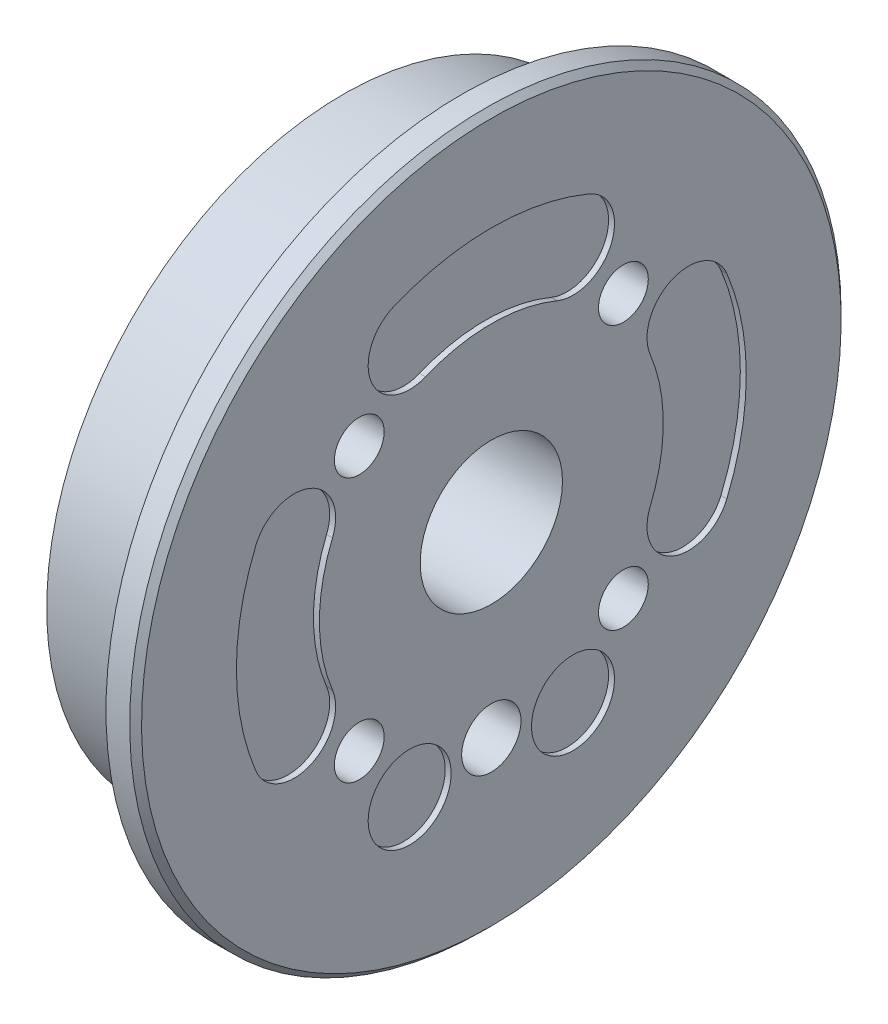
ISO-10303-21;
HEADER;
FILE_DESCRIPTION(('STEP AP214'),'2;1');
FILE_NAME('part.step','',(''),(''),'','','');
FILE_SCHEMA(('AUTOMOTIVE_DESIGN { 1 0 10303 214 1 1 1 1 }'));
ENDSEC;
DATA;
#1=APPLICATION_CONTEXT('core data for automotive mechanical design processes');
#2=APPLICATION_PROTOCOL_DEFINITION('international standard','automotive_design',2000,#1);
#3=PRODUCT_CONTEXT('',#1,'mechanical');
#4=PRODUCT('Part','Part','',(#3));
#5=PRODUCT_RELATED_PRODUCT_CATEGORY('part','',(#4));
#6=PRODUCT_DEFINITION_FORMATION('','',#4);
#7=PRODUCT_DEFINITION_CONTEXT('part definition',#1,'design');
#8=PRODUCT_DEFINITION('design','',#6,#7);
#9=PRODUCT_DEFINITION_SHAPE('','',#8);
#10=(LENGTH_UNIT() NAMED_UNIT(*) SI_UNIT(.MILLI.,.METRE.));
#11=(NAMED_UNIT(*) PLANE_ANGLE_UNIT() SI_UNIT($,.RADIAN.));
#12=(NAMED_UNIT(*) SI_UNIT($,.STERADIAN.) SOLID_ANGLE_UNIT());
#13=UNCERTAINTY_MEASURE_WITH_UNIT(LENGTH_MEASURE(1.E-05),#10,'distance_accuracy_value','');
#14=(GEOMETRIC_REPRESENTATION_CONTEXT(3) GLOBAL_UNCERTAINTY_ASSIGNED_CONTEXT((#13)) GLOBAL_UNIT_ASSIGNED_CONTEXT((#10,
#11,#12)) REPRESENTATION_CONTEXT('',''));
#15=CARTESIAN_POINT('',(0.,0.,0.));
#16=DIRECTION('',(0.,0.,1.));
#17=DIRECTION('',(1.,0.,0.));
#18=AXIS2_PLACEMENT_3D('',#15,#16,#17);
#19=CARTESIAN_POINT('',(0.,0.,0.));
#20=DIRECTION('',(1.,0.,0.));
#21=DIRECTION('',(0.,0.,-1.));
#22=AXIS2_PLACEMENT_3D('',#19,#20,#21);
#23=PLANE('',#22);
#24=CARTESIAN_POINT('',(0.,11.13693180369,-11.13693180369));
#25=DIRECTION('',(1.,0.,0.));
#26=DIRECTION('',(0.,0.,-1.));
#27=AXIS2_PLACEMENT_3D('',#24,#25,#26);
#28=CIRCLE('',#27,2.1);
#29=CARTESIAN_POINT('',(0.,11.13693180369,-13.23693180369));
#30=VERTEX_POINT('',#29);
#31=EDGE_CURVE('E242',#30,#30,#28,.T.);
#32=ORIENTED_EDGE('',*,*,#31,.T.);
#33=EDGE_LOOP('',(#32));
#34=FACE_BOUND('',#33,.T.);
#35=CARTESIAN_POINT('',(0.,0.,0.));
#36=DIRECTION('',(1.,0.,0.));
#37=DIRECTION('',(0.,0.,-1.));
#38=AXIS2_PLACEMENT_3D('',#35,#36,#37);
#39=CIRCLE('',#38,6.);
#40=CARTESIAN_POINT('',(0.,0.,-6.));
#41=VERTEX_POINT('',#40);
#42=EDGE_CURVE('E245',#41,#41,#39,.T.);
#43=ORIENTED_EDGE('',*,*,#42,.T.);
#44=EDGE_LOOP('',(#43));
#45=FACE_BOUND('',#44,.T.);
#46=CARTESIAN_POINT('',(0.,-11.13693180369,-11.13693180369));
#47=DIRECTION('',(1.,0.,0.));
#48=DIRECTION('',(0.,0.,-1.));
#49=AXIS2_PLACEMENT_3D('',#46,#47,#48);
#50=CIRCLE('',#49,2.1);
#51=CARTESIAN_POINT('',(0.,-11.13693180369,-13.23693180369));
#52=VERTEX_POINT('',#51);
#53=EDGE_CURVE('E249',#52,#52,#50,.T.);
#54=ORIENTED_EDGE('',*,*,#53,.T.);
#55=EDGE_LOOP('',(#54));
#56=FACE_BOUND('',#55,.T.);
#57=CARTESIAN_POINT('',(0.,-11.13693180369,11.13693180369));
#58=DIRECTION('',(1.,0.,0.));
#59=DIRECTION('',(0.,0.,-1.));
#60=AXIS2_PLACEMENT_3D('',#57,#58,#59);
#61=CIRCLE('',#60,2.1);
#62=CARTESIAN_POINT('',(0.,-11.13693180369,9.03693180369));
#63=VERTEX_POINT('',#62);
#64=EDGE_CURVE('E170',#63,#63,#61,.T.);
#65=ORIENTED_EDGE('',*,*,#64,.T.);
#66=EDGE_LOOP('',(#65));
#67=FACE_BOUND('',#66,.T.);
#68=CARTESIAN_POINT('',(0.,0.,0.));
#69=DIRECTION('',(1.,0.,0.));
#70=DIRECTION('',(0.,0.,-1.));
#71=AXIS2_PLACEMENT_3D('',#68,#69,#70);
#72=CIRCLE('',#71,25.);
#73=CARTESIAN_POINT('',(0.,0.,-25.));
#74=VERTEX_POINT('',#73);
#75=EDGE_CURVE('E174',#74,#74,#72,.F.);
#76=ORIENTED_EDGE('',*,*,#75,.T.);
#77=EDGE_LOOP('',(#76));
#78=FACE_BOUND('',#77,.T.);
#79=CARTESIAN_POINT('',(0.,11.13693180369,11.13693180369));
#80=DIRECTION('',(1.,0.,0.));
#81=DIRECTION('',(0.,0.,-1.));
#82=AXIS2_PLACEMENT_3D('',#79,#80,#81);
#83=CIRCLE('',#82,2.1);
#84=CARTESIAN_POINT('',(0.,11.13693180369,9.03693180369));
#85=VERTEX_POINT('',#84);
#86=EDGE_CURVE('E11',#85,#85,#83,.T.);
#87=ORIENTED_EDGE('',*,*,#86,.T.);
#88=EDGE_LOOP('',(#87));
#89=FACE_BOUND('',#88,.T.);
#90=ADVANCED_FACE('F34',(#34,#45,#56,#67,#78,#89),#23,.F.);
#91=CARTESIAN_POINT('',(10.,0.,0.));
#92=DIRECTION('',(1.,0.,0.));
#93=DIRECTION('',(0.,0.,-1.));
#94=AXIS2_PLACEMENT_3D('',#91,#92,#93);
#95=PLANE('',#94);
#96=CARTESIAN_POINT('',(10.,0.,0.));
#97=DIRECTION('',(1.,0.,0.));
#98=DIRECTION('',(0.,0.,-1.));
#99=AXIS2_PLACEMENT_3D('',#96,#97,#98);
#100=CIRCLE('',#99,30.);
#101=CARTESIAN_POINT('',(10.,0.,-30.));
#102=VERTEX_POINT('',#101);
#103=EDGE_CURVE('E237',#102,#102,#100,.T.);
#104=ORIENTED_EDGE('',*,*,#103,.F.);
#105=EDGE_LOOP('',(#104));
#106=FACE_BOUND('',#105,.T.);
#107=CARTESIAN_POINT('',(10.,0.,0.));
#108=DIRECTION('',(1.,0.,0.));
#109=DIRECTION('',(0.,0.,-1.));
#110=AXIS2_PLACEMENT_3D('',#107,#108,#109);
#111=CIRCLE('',#110,25.);
#112=CARTESIAN_POINT('',(10.,0.,-25.));
#113=VERTEX_POINT('',#112);
#114=EDGE_CURVE('E42',#113,#113,#111,.T.);
#115=ORIENTED_EDGE('',*,*,#114,.T.);
#116=EDGE_LOOP('',(#115));
#117=FACE_BOUND('',#116,.T.);
#118=ADVANCED_FACE('F275',(#106,#117),#95,.F.);
#119=CARTESIAN_POINT('',(-0.625,0.,0.));
#120=DIRECTION('',(1.,0.,0.));
#121=DIRECTION('',(0.,0.,-1.));
#122=AXIS2_PLACEMENT_3D('',#119,#120,#121);
#123=CYLINDRICAL_SURFACE('',#122,30.);
#124=CARTESIAN_POINT('',(12.,0.,0.));
#125=DIRECTION('',(-1.,0.,0.));
#126=DIRECTION('',(0.,0.,-1.));
#127=AXIS2_PLACEMENT_3D('',#124,#125,#126);
#128=CIRCLE('',#127,30.);
#129=CARTESIAN_POINT('',(12.,0.,-30.));
#130=VERTEX_POINT('',#129);
#131=EDGE_CURVE('E167',#130,#130,#128,.F.);
#132=ORIENTED_EDGE('',*,*,#131,.F.);
#133=EDGE_LOOP('',(#132));
#134=FACE_BOUND('',#133,.T.);
#135=ORIENTED_EDGE('',*,*,#103,.T.);
#136=EDGE_LOOP('',(#135));
#137=FACE_BOUND('',#136,.T.);
#138=ADVANCED_FACE('F282',(#134,#137),#123,.T.);
#139=CARTESIAN_POINT('',(-0.625,0.,0.));
#140=DIRECTION('',(1.,0.,0.));
#141=DIRECTION('',(0.,0.,-1.));
#142=AXIS2_PLACEMENT_3D('',#139,#140,#141);
#143=CYLINDRICAL_SURFACE('',#142,25.);
#144=ORIENTED_EDGE('',*,*,#75,.F.);
#145=EDGE_LOOP('',(#144));
#146=FACE_BOUND('',#145,.T.);
#147=ORIENTED_EDGE('',*,*,#114,.F.);
#148=EDGE_LOOP('',(#147));
#149=FACE_BOUND('',#148,.T.);
#150=ADVANCED_FACE('F287',(#146,#149),#143,.T.);
#151=CARTESIAN_POINT('',(5.5,0.,0.));
#152=DIRECTION('',(1.,0.,0.));
#153=DIRECTION('',(0.,0.,-1.));
#154=AXIS2_PLACEMENT_3D('',#151,#152,#153);
#155=PLANE('',#154);
#156=CARTESIAN_POINT('',(5.5,-15.75,0.));
#157=DIRECTION('',(1.,0.,0.));
#158=DIRECTION('',(0.,0.,-1.));
#159=AXIS2_PLACEMENT_3D('',#156,#157,#158);
#160=CIRCLE('',#159,2.5);
#161=CARTESIAN_POINT('',(5.5,-15.75,-2.5));
#162=VERTEX_POINT('',#161);
#163=EDGE_CURVE('E166',#162,#162,#160,.T.);
#164=ORIENTED_EDGE('',*,*,#163,.T.);
#165=EDGE_LOOP('',(#164));
#166=FACE_BOUND('',#165,.T.);
#167=ADVANCED_FACE('F296',(#166),#155,.T.);
#168=CARTESIAN_POINT('',(12.,0.,0.));
#169=DIRECTION('',(-1.,0.,0.));
#170=DIRECTION('',(0.,-1.,0.));
#171=AXIS2_PLACEMENT_3D('',#168,#169,#170);
#172=CONICAL_SURFACE('',#171,30.,0.785398163397301);
#173=CARTESIAN_POINT('',(12.5,0.,0.));
#174=DIRECTION('',(-1.,0.,0.));
#175=DIRECTION('',(0.,-1.,0.));
#176=AXIS2_PLACEMENT_3D('',#173,#174,#175);
#177=CIRCLE('',#176,29.5);
#178=CARTESIAN_POINT('',(12.5,-29.5,0.));
#179=VERTEX_POINT('',#178);
#180=EDGE_CURVE('E229',#179,#179,#177,.F.);
#181=ORIENTED_EDGE('',*,*,#180,.F.);
#182=EDGE_LOOP('',(#181));
#183=FACE_BOUND('',#182,.T.);
#184=ORIENTED_EDGE('',*,*,#131,.T.);
#185=EDGE_LOOP('',(#184));
#186=FACE_BOUND('',#185,.T.);
#187=ADVANCED_FACE('F306',(#183,#186),#172,.T.);
#188=CARTESIAN_POINT('',(12.5,-15.75,0.));
#189=DIRECTION('',(1.,0.,0.));
#190=DIRECTION('',(0.,0.,-1.));
#191=AXIS2_PLACEMENT_3D('',#188,#189,#190);
#192=CYLINDRICAL_SURFACE('',#191,2.5);
#193=ORIENTED_EDGE('',*,*,#163,.F.);
#194=EDGE_LOOP('',(#193));
#195=FACE_BOUND('',#194,.T.);
#196=CARTESIAN_POINT('',(12.5,-15.75,0.));
#197=DIRECTION('',(1.,0.,0.));
#198=DIRECTION('',(0.,0.,-1.));
#199=AXIS2_PLACEMENT_3D('',#196,#197,#198);
#200=CIRCLE('',#199,2.5);
#201=CARTESIAN_POINT('',(12.5,-15.75,-2.5));
#202=VERTEX_POINT('',#201);
#203=EDGE_CURVE('E226',#202,#202,#200,.F.);
#204=ORIENTED_EDGE('',*,*,#203,.F.);
#205=EDGE_LOOP('',(#204));
#206=FACE_BOUND('',#205,.T.);
#207=ADVANCED_FACE('F308',(#195,#206),#192,.F.);
#208=CARTESIAN_POINT('',(-0.8998976649558,-11.13693180369,-11.13693180369));
#209=DIRECTION('',(1.,0.,0.));
#210=DIRECTION('',(0.,0.,-1.));
#211=AXIS2_PLACEMENT_3D('',#208,#209,#210);
#212=CYLINDRICAL_SURFACE('',#211,2.1);
#213=CARTESIAN_POINT('',(12.5,-11.13693180369,-11.13693180369));
#214=DIRECTION('',(1.,0.,0.));
#215=DIRECTION('',(0.,0.,-1.));
#216=AXIS2_PLACEMENT_3D('',#213,#214,#215);
#217=CIRCLE('',#216,2.1);
#218=CARTESIAN_POINT('',(12.5,-11.13693180369,-13.23693180369));
#219=VERTEX_POINT('',#218);
#220=EDGE_CURVE('E223',#219,#219,#217,.F.);
#221=ORIENTED_EDGE('',*,*,#220,.F.);
#222=EDGE_LOOP('',(#221));
#223=FACE_BOUND('',#222,.T.);
#224=ORIENTED_EDGE('',*,*,#53,.F.);
#225=EDGE_LOOP('',(#224));
#226=FACE_BOUND('',#225,.T.);
#227=ADVANCED_FACE('F316',(#223,#226),#212,.F.);
#228=CARTESIAN_POINT('',(-0.8998976649558,11.13693180369,-11.13693180369));
#229=DIRECTION('',(1.,0.,0.));
#230=DIRECTION('',(0.,0.,-1.));
#231=AXIS2_PLACEMENT_3D('',#228,#229,#230);
#232=CYLINDRICAL_SURFACE('',#231,2.1);
#233=CARTESIAN_POINT('',(12.5,11.13693180369,-11.13693180369));
#234=DIRECTION('',(1.,0.,0.));
#235=DIRECTION('',(0.,0.,-1.));
#236=AXIS2_PLACEMENT_3D('',#233,#234,#235);
#237=CIRCLE('',#236,2.1);
#238=CARTESIAN_POINT('',(12.5,11.13693180369,-13.23693180369));
#239=VERTEX_POINT('',#238);
#240=EDGE_CURVE('E220',#239,#239,#237,.F.);
#241=ORIENTED_EDGE('',*,*,#240,.F.);
#242=EDGE_LOOP('',(#241));
#243=FACE_BOUND('',#242,.T.);
#244=ORIENTED_EDGE('',*,*,#31,.F.);
#245=EDGE_LOOP('',(#244));
#246=FACE_BOUND('',#245,.T.);
#247=ADVANCED_FACE('F36',(#243,#246),#232,.F.);
#248=CARTESIAN_POINT('',(-0.8998976649558,11.13693180369,11.13693180369));
#249=DIRECTION('',(1.,0.,0.));
#250=DIRECTION('',(0.,0.,-1.));
#251=AXIS2_PLACEMENT_3D('',#248,#249,#250);
#252=CYLINDRICAL_SURFACE('',#251,2.1);
#253=CARTESIAN_POINT('',(12.5,11.13693180369,11.13693180369));
#254=DIRECTION('',(1.,0.,0.));
#255=DIRECTION('',(0.,0.,-1.));
#256=AXIS2_PLACEMENT_3D('',#253,#254,#255);
#257=CIRCLE('',#256,2.1);
#258=CARTESIAN_POINT('',(12.5,11.13693180369,9.03693180369));
#259=VERTEX_POINT('',#258);
#260=EDGE_CURVE('E217',#259,#259,#257,.F.);
#261=ORIENTED_EDGE('',*,*,#260,.F.);
#262=EDGE_LOOP('',(#261));
#263=FACE_BOUND('',#262,.T.);
#264=ORIENTED_EDGE('',*,*,#86,.F.);
#265=EDGE_LOOP('',(#264));
#266=FACE_BOUND('',#265,.T.);
#267=ADVANCED_FACE('F259',(#263,#266),#252,.F.);
#268=CARTESIAN_POINT('',(-0.8998976649558,-11.13693180369,11.13693180369));
#269=DIRECTION('',(1.,0.,0.));
#270=DIRECTION('',(0.,0.,-1.));
#271=AXIS2_PLACEMENT_3D('',#268,#269,#270);
#272=CYLINDRICAL_SURFACE('',#271,2.1);
#273=CARTESIAN_POINT('',(12.5,-11.13693180369,11.13693180369));
#274=DIRECTION('',(1.,0.,0.));
#275=DIRECTION('',(0.,0.,-1.));
#276=AXIS2_PLACEMENT_3D('',#273,#274,#275);
#277=CIRCLE('',#276,2.1);
#278=CARTESIAN_POINT('',(12.5,-11.13693180369,9.03693180369));
#279=VERTEX_POINT('',#278);
#280=EDGE_CURVE('E214',#279,#279,#277,.F.);
#281=ORIENTED_EDGE('',*,*,#280,.F.);
#282=EDGE_LOOP('',(#281));
#283=FACE_BOUND('',#282,.T.);
#284=ORIENTED_EDGE('',*,*,#64,.F.);
#285=EDGE_LOOP('',(#284));
#286=FACE_BOUND('',#285,.T.);
#287=ADVANCED_FACE('F256',(#283,#286),#272,.F.);
#288=CARTESIAN_POINT('',(12.5,-16.6298315852,6.888301782572));
#289=DIRECTION('',(-1.,0.,0.));
#290=DIRECTION('',(0.,0.,1.));
#291=AXIS2_PLACEMENT_3D('',#288,#289,#290);
#292=CYLINDRICAL_SURFACE('',#291,3.5);
#293=CARTESIAN_POINT('',(12.,-16.6298315852,6.888301782572));
#294=DIRECTION('',(1.,0.,0.));
#295=DIRECTION('',(0.,0.,-1.));
#296=AXIS2_PLACEMENT_3D('',#293,#294,#295);
#297=CIRCLE('',#296,3.5);
#298=CARTESIAN_POINT('',(12.,-16.6298315852,3.388301782572));
#299=VERTEX_POINT('',#298);
#300=EDGE_CURVE('E621',#299,#299,#297,.T.);
#301=ORIENTED_EDGE('',*,*,#300,.F.);
#302=EDGE_LOOP('',(#301));
#303=FACE_BOUND('',#302,.T.);
#304=CARTESIAN_POINT('',(12.5,-16.6298315852,6.888301782572));
#305=DIRECTION('',(-1.,0.,0.));
#306=DIRECTION('',(0.,0.,1.));
#307=AXIS2_PLACEMENT_3D('',#304,#305,#306);
#308=CIRCLE('',#307,3.5);
#309=CARTESIAN_POINT('',(12.5,-16.6298315852,10.388301782572));
#310=VERTEX_POINT('',#309);
#311=EDGE_CURVE('E211',#310,#310,#308,.T.);
#312=ORIENTED_EDGE('',*,*,#311,.F.);
#313=EDGE_LOOP('',(#312));
#314=FACE_BOUND('',#313,.T.);
#315=ADVANCED_FACE('F258',(#303,#314),#292,.F.);
#316=CARTESIAN_POINT('',(12.5,-16.6298315852,-6.888301782572));
#317=DIRECTION('',(-1.,0.,0.));
#318=DIRECTION('',(0.,0.,1.));
#319=AXIS2_PLACEMENT_3D('',#316,#317,#318);
#320=CYLINDRICAL_SURFACE('',#319,3.5);
#321=CARTESIAN_POINT('',(12.,-16.6298315852,-6.888301782572));
#322=DIRECTION('',(1.,0.,0.));
#323=DIRECTION('',(0.,0.,-1.));
#324=AXIS2_PLACEMENT_3D('',#321,#322,#323);
#325=CIRCLE('',#324,3.5);
#326=CARTESIAN_POINT('',(12.,-16.6298315852,-10.388301782572));
#327=VERTEX_POINT('',#326);
#328=EDGE_CURVE('E618',#327,#327,#325,.T.);
#329=ORIENTED_EDGE('',*,*,#328,.F.);
#330=EDGE_LOOP('',(#329));
#331=FACE_BOUND('',#330,.T.);
#332=CARTESIAN_POINT('',(12.5,-16.6298315852,-6.888301782572));
#333=DIRECTION('',(-1.,0.,0.));
#334=DIRECTION('',(0.,0.,1.));
#335=AXIS2_PLACEMENT_3D('',#332,#333,#334);
#336=CIRCLE('',#335,3.5);
#337=CARTESIAN_POINT('',(12.5,-16.6298315852,-3.388301782572));
#338=VERTEX_POINT('',#337);
#339=EDGE_CURVE('E208',#338,#338,#336,.T.);
#340=ORIENTED_EDGE('',*,*,#339,.F.);
#341=EDGE_LOOP('',(#340));
#342=FACE_BOUND('',#341,.T.);
#343=ADVANCED_FACE('F267',(#331,#342),#320,.F.);
#344=CARTESIAN_POINT('',(12.5,16.6298315852,-6.888301782572));
#345=DIRECTION('',(-1.,0.,0.));
#346=DIRECTION('',(0.,0.,1.));
#347=AXIS2_PLACEMENT_3D('',#344,#345,#346);
#348=CYLINDRICAL_SURFACE('',#347,3.5);
#349=DIRECTION('',(1.,0.,0.));
#350=VECTOR('',#349,1.);
#351=CARTESIAN_POINT('',(12.5,19.8634099489924,-8.22769379585001));
#352=LINE('',#351,#350);
#353=CARTESIAN_POINT('',(12.5,19.8634099489909,-8.22769379585005));
#354=VERTEX_POINT('',#353);
#355=CARTESIAN_POINT('',(12.,19.8634099489924,-8.22769379585001));
#356=VERTEX_POINT('',#355);
#357=EDGE_CURVE('E158',#354,#356,#352,.F.);
#358=ORIENTED_EDGE('',*,*,#357,.T.);
#359=CARTESIAN_POINT('',(12.,16.6298315852,-6.888301782572));
#360=DIRECTION('',(1.,0.,0.));
#361=DIRECTION('',(0.,0.,-1.));
#362=AXIS2_PLACEMENT_3D('',#359,#360,#361);
#363=CIRCLE('',#362,3.5);
#364=CARTESIAN_POINT('',(12.,13.3962532214112,-5.54890976929432));
#365=VERTEX_POINT('',#364);
#366=EDGE_CURVE('E57',#365,#356,#363,.T.);
#367=ORIENTED_EDGE('',*,*,#366,.F.);
#368=DIRECTION('',(1.,0.,0.));
#369=VECTOR('',#368,1.);
#370=CARTESIAN_POINT('',(12.5,13.396253221413,-5.54890976929527));
#371=LINE('',#370,#369);
#372=CARTESIAN_POINT('',(12.5,13.3962532214131,-5.54890976929512));
#373=VERTEX_POINT('',#372);
#374=EDGE_CURVE('E163',#373,#365,#371,.F.);
#375=ORIENTED_EDGE('',*,*,#374,.F.);
#376=CARTESIAN_POINT('',(12.5,16.6298315852,-6.888301782572));
#377=DIRECTION('',(-1.,0.,0.));
#378=DIRECTION('',(0.,0.,1.));
#379=AXIS2_PLACEMENT_3D('',#376,#377,#378);
#380=CIRCLE('',#379,3.5);
#381=EDGE_CURVE('E205',#354,#373,#380,.T.);
#382=ORIENTED_EDGE('',*,*,#381,.F.);
#383=EDGE_LOOP('',(#358,#367,#375,#382));
#384=FACE_BOUND('',#383,.T.);
#385=ADVANCED_FACE('F325',(#384),#348,.F.);
#386=CARTESIAN_POINT('',(12.5,0.,0.));
#387=DIRECTION('',(1.,0.,0.));
#388=DIRECTION('',(0.,0.,-1.));
#389=AXIS2_PLACEMENT_3D('',#386,#387,#388);
#390=CYLINDRICAL_SURFACE('',#389,14.5);
#391=CARTESIAN_POINT('',(12.,0.,0.));
#392=DIRECTION('',(-1.,0.,0.));
#393=DIRECTION('',(0.,0.,-1.));
#394=AXIS2_PLACEMENT_3D('',#391,#392,#393);
#395=CIRCLE('',#394,14.4999999999979);
#396=CARTESIAN_POINT('',(12.,13.3962532214093,5.54890976929352));
#397=VERTEX_POINT('',#396);
#398=EDGE_CURVE('E617',#397,#365,#395,.T.);
#399=ORIENTED_EDGE('',*,*,#398,.F.);
#400=DIRECTION('',(-1.,0.,0.));
#401=VECTOR('',#400,1.);
#402=CARTESIAN_POINT('',(12.5,13.3962532214105,5.5489097692942));
#403=LINE('',#402,#401);
#404=CARTESIAN_POINT('',(12.5,13.3962532214105,5.54890976929405));
#405=VERTEX_POINT('',#404);
#406=EDGE_CURVE('E161',#397,#405,#403,.F.);
#407=ORIENTED_EDGE('',*,*,#406,.T.);
#408=CARTESIAN_POINT('',(12.5,0.,0.));
#409=DIRECTION('',(1.,0.,0.));
#410=DIRECTION('',(0.,0.,-1.));
#411=AXIS2_PLACEMENT_3D('',#408,#409,#410);
#412=CIRCLE('',#411,14.5);
#413=EDGE_CURVE('E202',#373,#405,#412,.T.);
#414=ORIENTED_EDGE('',*,*,#413,.F.);
#415=ORIENTED_EDGE('',*,*,#374,.T.);
#416=EDGE_LOOP('',(#399,#407,#414,#415));
#417=FACE_BOUND('',#416,.T.);
#418=ADVANCED_FACE('F329',(#417),#390,.T.);
#419=CARTESIAN_POINT('',(12.5,16.6298315852,6.888301782572));
#420=DIRECTION('',(-1.,0.,0.));
#421=DIRECTION('',(0.,0.,1.));
#422=AXIS2_PLACEMENT_3D('',#419,#420,#421);
#423=CYLINDRICAL_SURFACE('',#422,3.5);
#424=ORIENTED_EDGE('',*,*,#406,.F.);
#425=CARTESIAN_POINT('',(12.,16.6298315852,6.888301782572));
#426=DIRECTION('',(1.,0.,0.));
#427=DIRECTION('',(0.,0.,-1.));
#428=AXIS2_PLACEMENT_3D('',#425,#426,#427);
#429=CIRCLE('',#428,3.50000000000139);
#430=CARTESIAN_POINT('',(12.,19.8634099489915,8.22769379585032));
#431=VERTEX_POINT('',#430);
#432=EDGE_CURVE('E613',#431,#397,#429,.T.);
#433=ORIENTED_EDGE('',*,*,#432,.F.);
#434=DIRECTION('',(1.,0.,0.));
#435=VECTOR('',#434,1.);
#436=CARTESIAN_POINT('',(12.5,19.8634099489924,8.22769379585001));
#437=LINE('',#436,#435);
#438=CARTESIAN_POINT('',(12.5,19.8634099489922,8.22769379585058));
#439=VERTEX_POINT('',#438);
#440=EDGE_CURVE('E156',#431,#439,#437,.T.);
#441=ORIENTED_EDGE('',*,*,#440,.T.);
#442=CARTESIAN_POINT('',(12.5,16.6298315852,6.888301782572));
#443=DIRECTION('',(-1.,0.,0.));
#444=DIRECTION('',(0.,0.,1.));
#445=AXIS2_PLACEMENT_3D('',#442,#443,#444);
#446=CIRCLE('',#445,3.5);
#447=EDGE_CURVE('E199',#405,#439,#446,.T.);
#448=ORIENTED_EDGE('',*,*,#447,.F.);
#449=EDGE_LOOP('',(#424,#433,#441,#448));
#450=FACE_BOUND('',#449,.T.);
#451=ADVANCED_FACE('F333',(#450),#423,.F.);
#452=CARTESIAN_POINT('',(12.5,0.,0.));
#453=DIRECTION('',(1.,0.,0.));
#454=DIRECTION('',(0.,0.,-1.));
#455=AXIS2_PLACEMENT_3D('',#452,#453,#454);
#456=CYLINDRICAL_SURFACE('',#455,21.5);
#457=ORIENTED_EDGE('',*,*,#440,.F.);
#458=CARTESIAN_POINT('',(12.,0.,0.));
#459=DIRECTION('',(1.,0.,0.));
#460=DIRECTION('',(0.,0.,-1.));
#461=AXIS2_PLACEMENT_3D('',#458,#459,#460);
#462=CIRCLE('',#461,21.4999999999993);
#463=EDGE_CURVE('E615',#356,#431,#462,.T.);
#464=ORIENTED_EDGE('',*,*,#463,.F.);
#465=ORIENTED_EDGE('',*,*,#357,.F.);
#466=CARTESIAN_POINT('',(12.5,0.,0.));
#467=DIRECTION('',(1.,0.,0.));
#468=DIRECTION('',(0.,0.,-1.));
#469=AXIS2_PLACEMENT_3D('',#466,#467,#468);
#470=CIRCLE('',#469,21.5);
#471=EDGE_CURVE('E196',#439,#354,#470,.F.);
#472=ORIENTED_EDGE('',*,*,#471,.F.);
#473=EDGE_LOOP('',(#457,#464,#465,#472));
#474=FACE_BOUND('',#473,.T.);
#475=ADVANCED_FACE('F337',(#474),#456,.F.);
#476=CARTESIAN_POINT('',(12.5,6.888301782572,16.6298315852));
#477=DIRECTION('',(-1.,0.,0.));
#478=DIRECTION('',(0.,0.,1.));
#479=AXIS2_PLACEMENT_3D('',#476,#477,#478);
#480=CYLINDRICAL_SURFACE('',#479,3.5);
#481=DIRECTION('',(1.,0.,0.));
#482=VECTOR('',#481,1.);
#483=CARTESIAN_POINT('',(12.5,8.22769379585001,19.8634099489924));
#484=LINE('',#483,#482);
#485=CARTESIAN_POINT('',(12.5,8.22769379585005,19.8634099489909));
#486=VERTEX_POINT('',#485);
#487=CARTESIAN_POINT('',(12.,8.22769379585001,19.8634099489924));
#488=VERTEX_POINT('',#487);
#489=EDGE_CURVE('E144',#486,#488,#484,.F.);
#490=ORIENTED_EDGE('',*,*,#489,.T.);
#491=CARTESIAN_POINT('',(12.,6.888301782572,16.6298315852));
#492=DIRECTION('',(1.,0.,0.));
#493=DIRECTION('',(0.,0.,-1.));
#494=AXIS2_PLACEMENT_3D('',#491,#492,#493);
#495=CIRCLE('',#494,3.5);
#496=CARTESIAN_POINT('',(12.,5.54890976929432,13.3962532214112));
#497=VERTEX_POINT('',#496);
#498=EDGE_CURVE('E49',#497,#488,#495,.T.);
#499=ORIENTED_EDGE('',*,*,#498,.F.);
#500=DIRECTION('',(1.,0.,0.));
#501=VECTOR('',#500,1.);
#502=CARTESIAN_POINT('',(12.5,5.54890976929527,13.396253221413));
#503=LINE('',#502,#501);
#504=CARTESIAN_POINT('',(12.5,5.54890976929512,13.3962532214131));
#505=VERTEX_POINT('',#504);
#506=EDGE_CURVE('E153',#505,#497,#503,.F.);
#507=ORIENTED_EDGE('',*,*,#506,.F.);
#508=CARTESIAN_POINT('',(12.5,6.888301782572,16.6298315852));
#509=DIRECTION('',(-1.,0.,0.));
#510=DIRECTION('',(0.,0.,1.));
#511=AXIS2_PLACEMENT_3D('',#508,#509,#510);
#512=CIRCLE('',#511,3.5);
#513=EDGE_CURVE('E193',#486,#505,#512,.T.);
#514=ORIENTED_EDGE('',*,*,#513,.F.);
#515=EDGE_LOOP('',(#490,#499,#507,#514));
#516=FACE_BOUND('',#515,.T.);
#517=ADVANCED_FACE('F341',(#516),#480,.F.);
#518=CARTESIAN_POINT('',(12.5,0.,0.));
#519=DIRECTION('',(1.,0.,0.));
#520=DIRECTION('',(0.,0.,-1.));
#521=AXIS2_PLACEMENT_3D('',#518,#519,#520);
#522=CYLINDRICAL_SURFACE('',#521,14.5);
#523=CARTESIAN_POINT('',(12.,0.,0.));
#524=DIRECTION('',(-1.,0.,0.));
#525=DIRECTION('',(0.,0.,-1.));
#526=AXIS2_PLACEMENT_3D('',#523,#524,#525);
#527=CIRCLE('',#526,14.4999999999979);
#528=CARTESIAN_POINT('',(12.,-5.54890976929432,13.3962532214112));
#529=VERTEX_POINT('',#528);
#530=EDGE_CURVE('E137',#529,#497,#527,.T.);
#531=ORIENTED_EDGE('',*,*,#530,.F.);
#532=DIRECTION('',(-1.,0.,0.));
#533=VECTOR('',#532,1.);
#534=CARTESIAN_POINT('',(12.5,-5.5489097692942,13.3962532214105));
#535=LINE('',#534,#533);
#536=CARTESIAN_POINT('',(12.5,-5.54890976929405,13.3962532214105));
#537=VERTEX_POINT('',#536);
#538=EDGE_CURVE('E136',#529,#537,#535,.F.);
#539=ORIENTED_EDGE('',*,*,#538,.T.);
#540=CARTESIAN_POINT('',(12.5,0.,0.));
#541=DIRECTION('',(1.,0.,0.));
#542=DIRECTION('',(0.,0.,-1.));
#543=AXIS2_PLACEMENT_3D('',#540,#541,#542);
#544=CIRCLE('',#543,14.5);
#545=EDGE_CURVE('E190',#505,#537,#544,.T.);
#546=ORIENTED_EDGE('',*,*,#545,.F.);
#547=ORIENTED_EDGE('',*,*,#506,.T.);
#548=EDGE_LOOP('',(#531,#539,#546,#547));
#549=FACE_BOUND('',#548,.T.);
#550=ADVANCED_FACE('F345',(#549),#522,.T.);
#551=CARTESIAN_POINT('',(12.5,-6.888301782572,16.6298315852));
#552=DIRECTION('',(-1.,0.,0.));
#553=DIRECTION('',(0.,0.,1.));
#554=AXIS2_PLACEMENT_3D('',#551,#552,#553);
#555=CYLINDRICAL_SURFACE('',#554,3.5);
#556=ORIENTED_EDGE('',*,*,#538,.F.);
#557=CARTESIAN_POINT('',(12.,-6.888301782572,16.6298315852));
#558=DIRECTION('',(1.,0.,0.));
#559=DIRECTION('',(0.,0.,-1.));
#560=AXIS2_PLACEMENT_3D('',#557,#558,#559);
#561=CIRCLE('',#560,3.50000000000139);
#562=CARTESIAN_POINT('',(12.,-8.22769379585005,19.8634099489909));
#563=VERTEX_POINT('',#562);
#564=EDGE_CURVE('E123',#563,#529,#561,.T.);
#565=ORIENTED_EDGE('',*,*,#564,.F.);
#566=DIRECTION('',(1.,0.,0.));
#567=VECTOR('',#566,1.);
#568=CARTESIAN_POINT('',(12.5,-8.22769379585,19.8634099489924));
#569=LINE('',#568,#567);
#570=CARTESIAN_POINT('',(12.5,-8.22769379585058,19.8634099489922));
#571=VERTEX_POINT('',#570);
#572=EDGE_CURVE('E134',#563,#571,#569,.T.);
#573=ORIENTED_EDGE('',*,*,#572,.T.);
#574=CARTESIAN_POINT('',(12.5,-6.888301782572,16.6298315852));
#575=DIRECTION('',(-1.,0.,0.));
#576=DIRECTION('',(0.,0.,1.));
#577=AXIS2_PLACEMENT_3D('',#574,#575,#576);
#578=CIRCLE('',#577,3.5);
#579=EDGE_CURVE('E188',#537,#571,#578,.T.);
#580=ORIENTED_EDGE('',*,*,#579,.F.);
#581=EDGE_LOOP('',(#556,#565,#573,#580));
#582=FACE_BOUND('',#581,.T.);
#583=ADVANCED_FACE('F132',(#582),#555,.F.);
#584=CARTESIAN_POINT('',(12.5,0.,0.));
#585=DIRECTION('',(1.,0.,0.));
#586=DIRECTION('',(0.,0.,-1.));
#587=AXIS2_PLACEMENT_3D('',#584,#585,#586);
#588=CYLINDRICAL_SURFACE('',#587,21.5);
#589=ORIENTED_EDGE('',*,*,#572,.F.);
#590=CARTESIAN_POINT('',(12.,0.,0.));
#591=DIRECTION('',(1.,0.,0.));
#592=DIRECTION('',(0.,0.,-1.));
#593=AXIS2_PLACEMENT_3D('',#590,#591,#592);
#594=CIRCLE('',#593,21.4999999999993);
#595=EDGE_CURVE('E120',#488,#563,#594,.T.);
#596=ORIENTED_EDGE('',*,*,#595,.F.);
#597=ORIENTED_EDGE('',*,*,#489,.F.);
#598=CARTESIAN_POINT('',(12.5,0.,0.));
#599=DIRECTION('',(1.,0.,0.));
#600=DIRECTION('',(0.,0.,-1.));
#601=AXIS2_PLACEMENT_3D('',#598,#599,#600);
#602=CIRCLE('',#601,21.5);
#603=EDGE_CURVE('E141',#571,#486,#602,.F.);
#604=ORIENTED_EDGE('',*,*,#603,.F.);
#605=EDGE_LOOP('',(#589,#596,#597,#604));
#606=FACE_BOUND('',#605,.T.);
#607=ADVANCED_FACE('F139',(#606),#588,.F.);
#608=CARTESIAN_POINT('',(12.5,-6.888301782572,-16.6298315852));
#609=DIRECTION('',(-1.,0.,0.));
#610=DIRECTION('',(0.,0.,1.));
#611=AXIS2_PLACEMENT_3D('',#608,#609,#610);
#612=CYLINDRICAL_SURFACE('',#611,3.5);
#613=DIRECTION('',(1.,0.,0.));
#614=VECTOR('',#613,1.);
#615=CARTESIAN_POINT('',(12.5,-8.22769379585001,-19.8634099489924));
#616=LINE('',#615,#614);
#617=CARTESIAN_POINT('',(12.5,-8.22769379585005,-19.8634099489909));
#618=VERTEX_POINT('',#617);
#619=CARTESIAN_POINT('',(12.,-8.22769379585001,-19.8634099489924));
#620=VERTEX_POINT('',#619);
#621=EDGE_CURVE('E636',#618,#620,#616,.F.);
#622=ORIENTED_EDGE('',*,*,#621,.T.);
#623=CARTESIAN_POINT('',(12.,-6.888301782572,-16.6298315852));
#624=DIRECTION('',(1.,0.,0.));
#625=DIRECTION('',(0.,0.,-1.));
#626=AXIS2_PLACEMENT_3D('',#623,#624,#625);
#627=CIRCLE('',#626,3.5);
#628=CARTESIAN_POINT('',(12.,-5.54890976929432,-13.3962532214112));
#629=VERTEX_POINT('',#628);
#630=EDGE_CURVE('E628',#629,#620,#627,.T.);
#631=ORIENTED_EDGE('',*,*,#630,.F.);
#632=DIRECTION('',(1.,0.,0.));
#633=VECTOR('',#632,1.);
#634=CARTESIAN_POINT('',(12.5,-5.54890976929526,-13.396253221413));
#635=LINE('',#634,#633);
#636=CARTESIAN_POINT('',(12.5,-5.54890976929512,-13.3962532214131));
#637=VERTEX_POINT('',#636);
#638=EDGE_CURVE('E143',#637,#629,#635,.F.);
#639=ORIENTED_EDGE('',*,*,#638,.F.);
#640=CARTESIAN_POINT('',(12.5,-6.888301782572,-16.6298315852));
#641=DIRECTION('',(-1.,0.,0.));
#642=DIRECTION('',(0.,0.,1.));
#643=AXIS2_PLACEMENT_3D('',#640,#641,#642);
#644=CIRCLE('',#643,3.5);
#645=EDGE_CURVE('E184',#618,#637,#644,.T.);
#646=ORIENTED_EDGE('',*,*,#645,.F.);
#647=EDGE_LOOP('',(#622,#631,#639,#646));
#648=FACE_BOUND('',#647,.T.);
#649=ADVANCED_FACE('F354',(#648),#612,.F.);
#650=CARTESIAN_POINT('',(12.5,0.,0.));
#651=DIRECTION('',(1.,0.,0.));
#652=DIRECTION('',(0.,0.,-1.));
#653=AXIS2_PLACEMENT_3D('',#650,#651,#652);
#654=CYLINDRICAL_SURFACE('',#653,14.5);
#655=CARTESIAN_POINT('',(12.,0.,0.));
#656=DIRECTION('',(-1.,0.,0.));
#657=DIRECTION('',(0.,0.,-1.));
#658=AXIS2_PLACEMENT_3D('',#655,#656,#657);
#659=CIRCLE('',#658,14.4999999999979);
#660=CARTESIAN_POINT('',(12.,5.54890976929432,-13.3962532214112));
#661=VERTEX_POINT('',#660);
#662=EDGE_CURVE('E246',#661,#629,#659,.T.);
#663=ORIENTED_EDGE('',*,*,#662,.F.);
#664=DIRECTION('',(-1.,0.,0.));
#665=VECTOR('',#664,1.);
#666=CARTESIAN_POINT('',(12.5,5.5489097692942,-13.3962532214105));
#667=LINE('',#666,#665);
#668=CARTESIAN_POINT('',(12.5,5.54890976929405,-13.3962532214105));
#669=VERTEX_POINT('',#668);
#670=EDGE_CURVE('E147',#661,#669,#667,.F.);
#671=ORIENTED_EDGE('',*,*,#670,.T.);
#672=CARTESIAN_POINT('',(12.5,0.,0.));
#673=DIRECTION('',(1.,0.,0.));
#674=DIRECTION('',(0.,0.,-1.));
#675=AXIS2_PLACEMENT_3D('',#672,#673,#674);
#676=CIRCLE('',#675,14.5);
#677=EDGE_CURVE('E181',#637,#669,#676,.T.);
#678=ORIENTED_EDGE('',*,*,#677,.F.);
#679=ORIENTED_EDGE('',*,*,#638,.T.);
#680=EDGE_LOOP('',(#663,#671,#678,#679));
#681=FACE_BOUND('',#680,.T.);
#682=ADVANCED_FACE('F357',(#681),#654,.T.);
#683=CARTESIAN_POINT('',(12.5,6.888301782572,-16.6298315852));
#684=DIRECTION('',(-1.,0.,0.));
#685=DIRECTION('',(0.,0.,1.));
#686=AXIS2_PLACEMENT_3D('',#683,#684,#685);
#687=CYLINDRICAL_SURFACE('',#686,3.5);
#688=ORIENTED_EDGE('',*,*,#670,.F.);
#689=CARTESIAN_POINT('',(12.,6.888301782572,-16.6298315852));
#690=DIRECTION('',(1.,0.,0.));
#691=DIRECTION('',(0.,0.,-1.));
#692=AXIS2_PLACEMENT_3D('',#689,#690,#691);
#693=CIRCLE('',#692,3.50000000000139);
#694=CARTESIAN_POINT('',(12.,8.22769379585005,-19.8634099489909));
#695=VERTEX_POINT('',#694);
#696=EDGE_CURVE('E632',#695,#661,#693,.T.);
#697=ORIENTED_EDGE('',*,*,#696,.F.);
#698=DIRECTION('',(1.,0.,0.));
#699=VECTOR('',#698,1.);
#700=CARTESIAN_POINT('',(12.5,8.22769379585001,-19.8634099489924));
#701=LINE('',#700,#699);
#702=CARTESIAN_POINT('',(12.5,8.22769379585058,-19.8634099489922));
#703=VERTEX_POINT('',#702);
#704=EDGE_CURVE('E232',#695,#703,#701,.T.);
#705=ORIENTED_EDGE('',*,*,#704,.T.);
#706=CARTESIAN_POINT('',(12.5,6.888301782572,-16.6298315852));
#707=DIRECTION('',(-1.,0.,0.));
#708=DIRECTION('',(0.,0.,1.));
#709=AXIS2_PLACEMENT_3D('',#706,#707,#708);
#710=CIRCLE('',#709,3.5);
#711=EDGE_CURVE('E178',#669,#703,#710,.T.);
#712=ORIENTED_EDGE('',*,*,#711,.F.);
#713=EDGE_LOOP('',(#688,#697,#705,#712));
#714=FACE_BOUND('',#713,.T.);
#715=ADVANCED_FACE('F361',(#714),#687,.F.);
#716=CARTESIAN_POINT('',(12.5,0.,0.));
#717=DIRECTION('',(1.,0.,0.));
#718=DIRECTION('',(0.,0.,-1.));
#719=AXIS2_PLACEMENT_3D('',#716,#717,#718);
#720=CYLINDRICAL_SURFACE('',#719,21.5);
#721=ORIENTED_EDGE('',*,*,#704,.F.);
#722=CARTESIAN_POINT('',(12.,0.,0.));
#723=DIRECTION('',(1.,0.,0.));
#724=DIRECTION('',(0.,0.,-1.));
#725=AXIS2_PLACEMENT_3D('',#722,#723,#724);
#726=CIRCLE('',#725,21.4999999999993);
#727=EDGE_CURVE('E630',#620,#695,#726,.T.);
#728=ORIENTED_EDGE('',*,*,#727,.F.);
#729=ORIENTED_EDGE('',*,*,#621,.F.);
#730=CARTESIAN_POINT('',(12.5,0.,0.));
#731=DIRECTION('',(1.,0.,0.));
#732=DIRECTION('',(0.,0.,-1.));
#733=AXIS2_PLACEMENT_3D('',#730,#731,#732);
#734=CIRCLE('',#733,21.5);
#735=EDGE_CURVE('E175',#703,#618,#734,.F.);
#736=ORIENTED_EDGE('',*,*,#735,.F.);
#737=EDGE_LOOP('',(#721,#728,#729,#736));
#738=FACE_BOUND('',#737,.T.);
#739=ADVANCED_FACE('F365',(#738),#720,.F.);
#740=CARTESIAN_POINT('',(-0.625,0.,0.));
#741=DIRECTION('',(1.,0.,0.));
#742=DIRECTION('',(0.,0.,-1.));
#743=AXIS2_PLACEMENT_3D('',#740,#741,#742);
#744=CYLINDRICAL_SURFACE('',#743,6.);
#745=CARTESIAN_POINT('',(12.5,0.,0.));
#746=DIRECTION('',(1.,0.,0.));
#747=DIRECTION('',(0.,0.,-1.));
#748=AXIS2_PLACEMENT_3D('',#745,#746,#747);
#749=CIRCLE('',#748,6.);
#750=CARTESIAN_POINT('',(12.5,0.,-6.));
#751=VERTEX_POINT('',#750);
#752=EDGE_CURVE('E171',#751,#751,#749,.F.);
#753=ORIENTED_EDGE('',*,*,#752,.F.);
#754=EDGE_LOOP('',(#753));
#755=FACE_BOUND('',#754,.T.);
#756=ORIENTED_EDGE('',*,*,#42,.F.);
#757=EDGE_LOOP('',(#756));
#758=FACE_BOUND('',#757,.T.);
#759=ADVANCED_FACE('F369',(#755,#758),#744,.F.);
#760=CARTESIAN_POINT('',(12.5,0.,0.));
#761=DIRECTION('',(1.,0.,0.));
#762=DIRECTION('',(0.,0.,-1.));
#763=AXIS2_PLACEMENT_3D('',#760,#761,#762);
#764=PLANE('',#763);
#765=ORIENTED_EDGE('',*,*,#752,.T.);
#766=EDGE_LOOP('',(#765));
#767=FACE_BOUND('',#766,.T.);
#768=ORIENTED_EDGE('',*,*,#711,.T.);
#769=ORIENTED_EDGE('',*,*,#735,.T.);
#770=ORIENTED_EDGE('',*,*,#645,.T.);
#771=ORIENTED_EDGE('',*,*,#677,.T.);
#772=EDGE_LOOP('',(#768,#769,#770,#771));
#773=FACE_BOUND('',#772,.T.);
#774=ORIENTED_EDGE('',*,*,#579,.T.);
#775=ORIENTED_EDGE('',*,*,#603,.T.);
#776=ORIENTED_EDGE('',*,*,#513,.T.);
#777=ORIENTED_EDGE('',*,*,#545,.T.);
#778=EDGE_LOOP('',(#774,#775,#776,#777));
#779=FACE_BOUND('',#778,.T.);
#780=ORIENTED_EDGE('',*,*,#447,.T.);
#781=ORIENTED_EDGE('',*,*,#471,.T.);
#782=ORIENTED_EDGE('',*,*,#381,.T.);
#783=ORIENTED_EDGE('',*,*,#413,.T.);
#784=EDGE_LOOP('',(#780,#781,#782,#783));
#785=FACE_BOUND('',#784,.T.);
#786=ORIENTED_EDGE('',*,*,#339,.T.);
#787=EDGE_LOOP('',(#786));
#788=FACE_BOUND('',#787,.T.);
#789=ORIENTED_EDGE('',*,*,#311,.T.);
#790=EDGE_LOOP('',(#789));
#791=FACE_BOUND('',#790,.T.);
#792=ORIENTED_EDGE('',*,*,#280,.T.);
#793=EDGE_LOOP('',(#792));
#794=FACE_BOUND('',#793,.T.);
#795=ORIENTED_EDGE('',*,*,#260,.T.);
#796=EDGE_LOOP('',(#795));
#797=FACE_BOUND('',#796,.T.);
#798=ORIENTED_EDGE('',*,*,#240,.T.);
#799=EDGE_LOOP('',(#798));
#800=FACE_BOUND('',#799,.T.);
#801=ORIENTED_EDGE('',*,*,#220,.T.);
#802=EDGE_LOOP('',(#801));
#803=FACE_BOUND('',#802,.T.);
#804=ORIENTED_EDGE('',*,*,#203,.T.);
#805=EDGE_LOOP('',(#804));
#806=FACE_BOUND('',#805,.T.);
#807=ORIENTED_EDGE('',*,*,#180,.T.);
#808=EDGE_LOOP('',(#807));
#809=FACE_BOUND('',#808,.T.);
#810=ADVANCED_FACE('F298',(#767,#773,#779,#785,#788,#791,#794,#797,#800,#803,#806,#809),#764,.T.);
#811=CARTESIAN_POINT('',(12.,-3.444150891286,-8.3149157926));
#812=DIRECTION('',(1.,0.,0.));
#813=DIRECTION('',(0.,0.,-1.));
#814=AXIS2_PLACEMENT_3D('',#811,#812,#813);
#815=PLANE('',#814);
#816=ORIENTED_EDGE('',*,*,#630,.T.);
#817=ORIENTED_EDGE('',*,*,#727,.T.);
#818=ORIENTED_EDGE('',*,*,#696,.T.);
#819=ORIENTED_EDGE('',*,*,#662,.T.);
#820=EDGE_LOOP('',(#816,#817,#818,#819));
#821=FACE_BOUND('',#820,.T.);
#822=ADVANCED_FACE('F320',(#821),#815,.T.);
#823=CARTESIAN_POINT('',(12.,-16.6298315852,6.888301782572));
#824=DIRECTION('',(1.,0.,0.));
#825=DIRECTION('',(0.,0.,-1.));
#826=AXIS2_PLACEMENT_3D('',#823,#824,#825);
#827=PLANE('',#826);
#828=ORIENTED_EDGE('',*,*,#300,.T.);
#829=EDGE_LOOP('',(#828));
#830=FACE_BOUND('',#829,.T.);
#831=ADVANCED_FACE('F376',(#830),#827,.T.);
#832=CARTESIAN_POINT('',(12.,-16.6298315852,-6.888301782572));
#833=DIRECTION('',(1.,0.,0.));
#834=DIRECTION('',(0.,0.,-1.));
#835=AXIS2_PLACEMENT_3D('',#832,#833,#834);
#836=PLANE('',#835);
#837=ORIENTED_EDGE('',*,*,#328,.T.);
#838=EDGE_LOOP('',(#837));
#839=FACE_BOUND('',#838,.T.);
#840=ADVANCED_FACE('F380',(#839),#836,.T.);
#841=CARTESIAN_POINT('',(12.,8.3149157926,-3.444150891286));
#842=DIRECTION('',(1.,0.,0.));
#843=DIRECTION('',(0.,0.,-1.));
#844=AXIS2_PLACEMENT_3D('',#841,#842,#843);
#845=PLANE('',#844);
#846=ORIENTED_EDGE('',*,*,#366,.T.);
#847=ORIENTED_EDGE('',*,*,#463,.T.);
#848=ORIENTED_EDGE('',*,*,#432,.T.);
#849=ORIENTED_EDGE('',*,*,#398,.T.);
#850=EDGE_LOOP('',(#846,#847,#848,#849));
#851=FACE_BOUND('',#850,.T.);
#852=ADVANCED_FACE('F384',(#851),#845,.T.);
#853=CARTESIAN_POINT('',(12.,3.444150891286,8.3149157926));
#854=DIRECTION('',(1.,0.,0.));
#855=DIRECTION('',(0.,0.,-1.));
#856=AXIS2_PLACEMENT_3D('',#853,#854,#855);
#857=PLANE('',#856);
#858=ORIENTED_EDGE('',*,*,#498,.T.);
#859=ORIENTED_EDGE('',*,*,#595,.T.);
#860=ORIENTED_EDGE('',*,*,#564,.T.);
#861=ORIENTED_EDGE('',*,*,#530,.T.);
#862=EDGE_LOOP('',(#858,#859,#860,#861));
#863=FACE_BOUND('',#862,.T.);
#864=ADVANCED_FACE('F122',(#863),#857,.T.);
#865=CLOSED_SHELL('',(#90,#118,#138,#150,#167,#187,#207,#227,#247,#267,#287,#315,#343,#385,#418,
#451,#475,#517,#550,#583,#607,#649,#682,#715,#739,#759,#810,#822,#831,#840,#852,#864));
#866=MANIFOLD_SOLID_BREP('B2',#865);
#867=ADVANCED_BREP_SHAPE_REPRESENTATION('',(#18,#866),#14);
#868=SHAPE_DEFINITION_REPRESENTATION(#9,#867);
ENDSEC;
END-ISO-10303-21;
